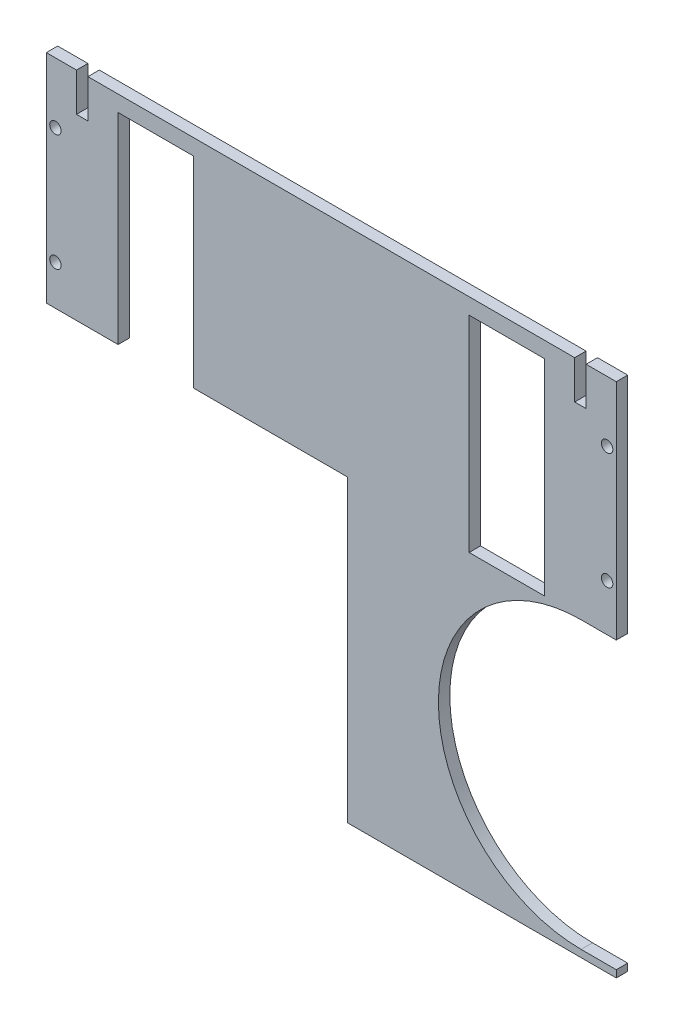
ISO-10303-21;
HEADER;
FILE_DESCRIPTION(('STEP AP214'),'2;1');
FILE_NAME('part.step','',(''),(''),'','','');
FILE_SCHEMA(('AUTOMOTIVE_DESIGN { 1 0 10303 214 1 1 1 1 }'));
ENDSEC;
DATA;
#1=APPLICATION_CONTEXT('core data for automotive mechanical design processes');
#2=APPLICATION_PROTOCOL_DEFINITION('international standard','automotive_design',2000,#1);
#3=PRODUCT_CONTEXT('',#1,'mechanical');
#4=PRODUCT('Part','Part','',(#3));
#5=PRODUCT_RELATED_PRODUCT_CATEGORY('part','',(#4));
#6=PRODUCT_DEFINITION_FORMATION('','',#4);
#7=PRODUCT_DEFINITION_CONTEXT('part definition',#1,'design');
#8=PRODUCT_DEFINITION('design','',#6,#7);
#9=PRODUCT_DEFINITION_SHAPE('','',#8);
#10=(LENGTH_UNIT() NAMED_UNIT(*) SI_UNIT(.MILLI.,.METRE.));
#11=(NAMED_UNIT(*) PLANE_ANGLE_UNIT() SI_UNIT($,.RADIAN.));
#12=(NAMED_UNIT(*) SI_UNIT($,.STERADIAN.) SOLID_ANGLE_UNIT());
#13=UNCERTAINTY_MEASURE_WITH_UNIT(LENGTH_MEASURE(1.E-05),#10,'distance_accuracy_value','');
#14=(GEOMETRIC_REPRESENTATION_CONTEXT(3) GLOBAL_UNCERTAINTY_ASSIGNED_CONTEXT((#13)) GLOBAL_UNIT_ASSIGNED_CONTEXT((#10,
#11,#12)) REPRESENTATION_CONTEXT('',''));
#15=CARTESIAN_POINT('',(0.,0.,0.));
#16=DIRECTION('',(0.,0.,1.));
#17=DIRECTION('',(1.,0.,0.));
#18=AXIS2_PLACEMENT_3D('',#15,#16,#17);
#19=CARTESIAN_POINT('',(8.39606162372775E-13,-69.0000000000026,5.));
#20=DIRECTION('',(0.,-1.,0.));
#21=DIRECTION('',(1.,0.,0.));
#22=AXIS2_PLACEMENT_3D('',#19,#20,#21);
#23=PLANE('',#22);
#24=DIRECTION('',(-1.,0.,0.));
#25=VECTOR('',#24,1.);
#26=CARTESIAN_POINT('',(8.39606162372775E-13,-69.0000000000026,5.));
#27=LINE('',#26,#25);
#28=CARTESIAN_POINT('',(13.22,-69.0000000000026,5.));
#29=VERTEX_POINT('',#28);
#30=CARTESIAN_POINT('',(8.39606162372775E-13,-69.0000000000026,5.));
#31=VERTEX_POINT('',#30);
#32=EDGE_CURVE('E400',#29,#31,#27,.T.);
#33=ORIENTED_EDGE('',*,*,#32,.F.);
#34=DIRECTION('',(0.,0.,-1.));
#35=VECTOR('',#34,1.);
#36=CARTESIAN_POINT('',(13.22,-69.0000000000026,5.));
#37=LINE('',#36,#35);
#38=CARTESIAN_POINT('',(13.22,-69.0000000000026,0.));
#39=VERTEX_POINT('',#38);
#40=EDGE_CURVE('E11',#29,#39,#37,.T.);
#41=ORIENTED_EDGE('',*,*,#40,.T.);
#42=DIRECTION('',(-1.,0.,0.));
#43=VECTOR('',#42,1.);
#44=CARTESIAN_POINT('',(8.39606162372775E-13,-69.0000000000026,0.));
#45=LINE('',#44,#43);
#46=CARTESIAN_POINT('',(8.39606162372775E-13,-69.0000000000026,0.));
#47=VERTEX_POINT('',#46);
#48=EDGE_CURVE('E408',#39,#47,#45,.T.);
#49=ORIENTED_EDGE('',*,*,#48,.T.);
#50=DIRECTION('',(0.,0.,-1.));
#51=VECTOR('',#50,1.);
#52=CARTESIAN_POINT('',(8.39606162372775E-13,-69.0000000000026,5.));
#53=LINE('',#52,#51);
#54=EDGE_CURVE('E398',#31,#47,#53,.T.);
#55=ORIENTED_EDGE('',*,*,#54,.F.);
#56=EDGE_LOOP('',(#33,#41,#49,#55));
#57=FACE_BOUND('',#56,.T.);
#58=ADVANCED_FACE('F33',(#57),#23,.F.);
#59=CARTESIAN_POINT('',(231.38,-69.0000000000026,0.));
#60=VERTEX_POINT('',#59);
#61=CARTESIAN_POINT('',(18.22,-69.0000000000026,0.));
#62=VERTEX_POINT('',#61);
#63=EDGE_CURVE('E232',#60,#62,#45,.T.);
#64=ORIENTED_EDGE('',*,*,#63,.T.);
#65=DIRECTION('',(0.,0.,1.));
#66=VECTOR('',#65,1.);
#67=CARTESIAN_POINT('',(18.22,-69.0000000000026,5.));
#68=LINE('',#67,#66);
#69=CARTESIAN_POINT('',(18.22,-69.0000000000026,5.));
#70=VERTEX_POINT('',#69);
#71=EDGE_CURVE('E41',#62,#70,#68,.T.);
#72=ORIENTED_EDGE('',*,*,#71,.T.);
#73=CARTESIAN_POINT('',(231.38,-69.0000000000026,5.));
#74=VERTEX_POINT('',#73);
#75=EDGE_CURVE('E399',#74,#70,#27,.T.);
#76=ORIENTED_EDGE('',*,*,#75,.F.);
#77=DIRECTION('',(0.,0.,-1.));
#78=VECTOR('',#77,1.);
#79=CARTESIAN_POINT('',(231.38,-69.0000000000026,5.));
#80=LINE('',#79,#78);
#81=EDGE_CURVE('E424',#74,#60,#80,.T.);
#82=ORIENTED_EDGE('',*,*,#81,.T.);
#83=EDGE_LOOP('',(#64,#72,#76,#82));
#84=FACE_BOUND('',#83,.T.);
#85=ADVANCED_FACE('F428',(#84),#23,.F.);
#86=CARTESIAN_POINT('',(249.600000000001,-69.0000000000026,5.));
#87=DIRECTION('',(-1.,0.,0.));
#88=DIRECTION('',(0.,-1.,0.));
#89=AXIS2_PLACEMENT_3D('',#86,#87,#88);
#90=PLANE('',#89);
#91=DIRECTION('',(0.,1.,0.));
#92=VECTOR('',#91,1.);
#93=CARTESIAN_POINT('',(249.600000000001,-69.0000000000026,5.));
#94=LINE('',#93,#92);
#95=CARTESIAN_POINT('',(249.600000000001,-167.000000000003,5.));
#96=VERTEX_POINT('',#95);
#97=CARTESIAN_POINT('',(249.600000000001,-69.0000000000026,5.));
#98=VERTEX_POINT('',#97);
#99=EDGE_CURVE('E391',#96,#98,#94,.T.);
#100=ORIENTED_EDGE('',*,*,#99,.F.);
#101=DIRECTION('',(0.,0.,-1.));
#102=VECTOR('',#101,1.);
#103=CARTESIAN_POINT('',(249.600000000001,-167.000000000003,5.));
#104=LINE('',#103,#102);
#105=CARTESIAN_POINT('',(249.600000000001,-167.000000000003,0.));
#106=VERTEX_POINT('',#105);
#107=EDGE_CURVE('E419',#96,#106,#104,.T.);
#108=ORIENTED_EDGE('',*,*,#107,.T.);
#109=DIRECTION('',(0.,1.,0.));
#110=VECTOR('',#109,1.);
#111=CARTESIAN_POINT('',(249.600000000001,-69.0000000000026,0.));
#112=LINE('',#111,#110);
#113=CARTESIAN_POINT('',(249.600000000001,-69.0000000000026,0.));
#114=VERTEX_POINT('',#113);
#115=EDGE_CURVE('E403',#106,#114,#112,.T.);
#116=ORIENTED_EDGE('',*,*,#115,.T.);
#117=DIRECTION('',(0.,0.,-1.));
#118=VECTOR('',#117,1.);
#119=CARTESIAN_POINT('',(249.600000000001,-69.0000000000026,5.));
#120=LINE('',#119,#118);
#121=EDGE_CURVE('E411',#98,#114,#120,.T.);
#122=ORIENTED_EDGE('',*,*,#121,.F.);
#123=EDGE_LOOP('',(#100,#108,#116,#122));
#124=FACE_BOUND('',#123,.T.);
#125=ADVANCED_FACE('F460',(#124),#90,.F.);
#126=CARTESIAN_POINT('',(0.,0.,5.));
#127=DIRECTION('',(0.,0.,1.));
#128=DIRECTION('',(1.,0.,0.));
#129=AXIS2_PLACEMENT_3D('',#126,#127,#128);
#130=PLANE('',#129);
#131=DIRECTION('',(0.,-1.,0.));
#132=VECTOR('',#131,1.);
#133=CARTESIAN_POINT('',(13.22,-60.8123202998395,5.));
#134=LINE('',#133,#132);
#135=CARTESIAN_POINT('',(13.22,-85.8123202998395,5.));
#136=VERTEX_POINT('',#135);
#137=EDGE_CURVE('E252',#29,#136,#134,.T.);
#138=ORIENTED_EDGE('',*,*,#137,.F.);
#139=ORIENTED_EDGE('',*,*,#32,.T.);
#140=DIRECTION('',(0.,-1.,0.));
#141=VECTOR('',#140,1.);
#142=CARTESIAN_POINT('',(8.39606162372775E-13,-69.0000000000026,5.));
#143=LINE('',#142,#141);
#144=CARTESIAN_POINT('',(8.32667268468867E-13,-164.000000000003,5.));
#145=VERTEX_POINT('',#144);
#146=EDGE_CURVE('E388',#31,#145,#143,.T.);
#147=ORIENTED_EDGE('',*,*,#146,.T.);
#148=DIRECTION('',(-1.,0.,0.));
#149=VECTOR('',#148,1.);
#150=CARTESIAN_POINT('',(8.32667268468867E-13,-164.000000000003,5.));
#151=LINE('',#150,#149);
#152=CARTESIAN_POINT('',(31.4400000000009,-164.000000000003,5.));
#153=VERTEX_POINT('',#152);
#154=EDGE_CURVE('E296',#153,#145,#151,.T.);
#155=ORIENTED_EDGE('',*,*,#154,.F.);
#156=DIRECTION('',(0.,-1.,0.));
#157=VECTOR('',#156,1.);
#158=CARTESIAN_POINT('',(31.4400000000009,-76.0000000000026,5.));
#159=LINE('',#158,#157);
#160=CARTESIAN_POINT('',(31.4400000000009,-76.0000000000026,5.));
#161=VERTEX_POINT('',#160);
#162=EDGE_CURVE('E314',#161,#153,#159,.T.);
#163=ORIENTED_EDGE('',*,*,#162,.F.);
#164=DIRECTION('',(-1.,0.,0.));
#165=VECTOR('',#164,1.);
#166=CARTESIAN_POINT('',(64.4400000000009,-76.0000000000026,5.));
#167=LINE('',#166,#165);
#168=CARTESIAN_POINT('',(64.4400000000009,-76.0000000000026,5.));
#169=VERTEX_POINT('',#168);
#170=EDGE_CURVE('E312',#169,#161,#167,.T.);
#171=ORIENTED_EDGE('',*,*,#170,.F.);
#172=DIRECTION('',(0.,1.,0.));
#173=VECTOR('',#172,1.);
#174=CARTESIAN_POINT('',(64.4400000000009,-76.0000000000026,5.));
#175=LINE('',#174,#173);
#176=CARTESIAN_POINT('',(64.4400000000009,-164.000000000003,5.));
#177=VERTEX_POINT('',#176);
#178=EDGE_CURVE('E318',#177,#169,#175,.T.);
#179=ORIENTED_EDGE('',*,*,#178,.F.);
#180=CARTESIAN_POINT('',(132.000000000001,-164.000000000003,5.));
#181=VERTEX_POINT('',#180);
#182=EDGE_CURVE('E297',#181,#177,#151,.T.);
#183=ORIENTED_EDGE('',*,*,#182,.F.);
#184=DIRECTION('',(0.,1.,0.));
#185=VECTOR('',#184,1.);
#186=CARTESIAN_POINT('',(132.000000000001,-295.148008476666,5.));
#187=LINE('',#186,#185);
#188=CARTESIAN_POINT('',(132.000000000001,-295.148008476666,5.));
#189=VERTEX_POINT('',#188);
#190=EDGE_CURVE('E280',#189,#181,#187,.T.);
#191=ORIENTED_EDGE('',*,*,#190,.F.);
#192=DIRECTION('',(-1.,0.,0.));
#193=VECTOR('',#192,1.);
#194=CARTESIAN_POINT('',(132.000000000001,-295.148008476666,5.));
#195=LINE('',#194,#193);
#196=CARTESIAN_POINT('',(249.600000000001,-295.148008476666,5.));
#197=VERTEX_POINT('',#196);
#198=EDGE_CURVE('E286',#197,#189,#195,.T.);
#199=ORIENTED_EDGE('',*,*,#198,.F.);
#200=CARTESIAN_POINT('',(249.600000000001,-292.000000000003,5.));
#201=VERTEX_POINT('',#200);
#202=EDGE_CURVE('E394',#197,#201,#94,.T.);
#203=ORIENTED_EDGE('',*,*,#202,.T.);
#204=DIRECTION('',(1.,0.,0.));
#205=VECTOR('',#204,1.);
#206=CARTESIAN_POINT('',(234.205987927565,-292.000000000003,5.));
#207=LINE('',#206,#205);
#208=CARTESIAN_POINT('',(234.205987927565,-292.000000000003,5.));
#209=VERTEX_POINT('',#208);
#210=EDGE_CURVE('E274',#209,#201,#207,.T.);
#211=ORIENTED_EDGE('',*,*,#210,.F.);
#212=CARTESIAN_POINT('',(234.205987927565,-229.500000000003,5.));
#213=DIRECTION('',(0.,0.,1.));
#214=DIRECTION('',(1.,0.,0.));
#215=AXIS2_PLACEMENT_3D('',#212,#213,#214);
#216=CIRCLE('',#215,62.5);
#217=CARTESIAN_POINT('',(234.205987927565,-167.000000000003,5.));
#218=VERTEX_POINT('',#217);
#219=EDGE_CURVE('E241',#218,#209,#216,.T.);
#220=ORIENTED_EDGE('',*,*,#219,.F.);
#221=DIRECTION('',(-1.,0.,0.));
#222=VECTOR('',#221,1.);
#223=CARTESIAN_POINT('',(296.705987927565,-167.000000000003,5.));
#224=LINE('',#223,#222);
#225=EDGE_CURVE('E265',#96,#218,#224,.T.);
#226=ORIENTED_EDGE('',*,*,#225,.F.);
#227=ORIENTED_EDGE('',*,*,#99,.T.);
#228=CARTESIAN_POINT('',(236.38,-69.0000000000026,5.));
#229=VERTEX_POINT('',#228);
#230=EDGE_CURVE('E395',#98,#229,#27,.T.);
#231=ORIENTED_EDGE('',*,*,#230,.T.);
#232=DIRECTION('',(0.,1.,0.));
#233=VECTOR('',#232,1.);
#234=CARTESIAN_POINT('',(236.38,-60.8123202998395,5.));
#235=LINE('',#234,#233);
#236=CARTESIAN_POINT('',(236.38,-85.8123202998395,5.));
#237=VERTEX_POINT('',#236);
#238=EDGE_CURVE('E56',#237,#229,#235,.T.);
#239=ORIENTED_EDGE('',*,*,#238,.F.);
#240=DIRECTION('',(1.,0.,0.));
#241=VECTOR('',#240,1.);
#242=CARTESIAN_POINT('',(231.38,-85.8123202998395,5.));
#243=LINE('',#242,#241);
#244=CARTESIAN_POINT('',(231.38,-85.8123202998395,5.));
#245=VERTEX_POINT('',#244);
#246=EDGE_CURVE('E234',#245,#237,#243,.T.);
#247=ORIENTED_EDGE('',*,*,#246,.F.);
#248=DIRECTION('',(0.,-1.,0.));
#249=VECTOR('',#248,1.);
#250=CARTESIAN_POINT('',(231.38,-60.8123202998395,5.));
#251=LINE('',#250,#249);
#252=EDGE_CURVE('E212',#74,#245,#251,.T.);
#253=ORIENTED_EDGE('',*,*,#252,.F.);
#254=ORIENTED_EDGE('',*,*,#75,.T.);
#255=DIRECTION('',(0.,1.,0.));
#256=VECTOR('',#255,1.);
#257=CARTESIAN_POINT('',(18.22,-60.8123202998395,5.));
#258=LINE('',#257,#256);
#259=CARTESIAN_POINT('',(18.22,-85.8123202998395,5.));
#260=VERTEX_POINT('',#259);
#261=EDGE_CURVE('E48',#260,#70,#258,.T.);
#262=ORIENTED_EDGE('',*,*,#261,.F.);
#263=DIRECTION('',(1.,0.,0.));
#264=VECTOR('',#263,1.);
#265=CARTESIAN_POINT('',(13.22,-85.8123202998395,5.));
#266=LINE('',#265,#264);
#267=EDGE_CURVE('E254',#136,#260,#266,.T.);
#268=ORIENTED_EDGE('',*,*,#267,.F.);
#269=EDGE_LOOP('',(#138,#139,#147,#155,#163,#171,#179,#183,#191,#199,#203,#211,#220,#226,#227,
#231,#239,#247,#253,#254,#262,#268));
#270=FACE_BOUND('',#269,.T.);
#271=CARTESIAN_POINT('',(4.00000000000086,-146.500000000003,5.));
#272=DIRECTION('',(0.,0.,1.));
#273=DIRECTION('',(-1.,0.,0.));
#274=AXIS2_PLACEMENT_3D('',#271,#272,#273);
#275=CIRCLE('',#274,2.50000000000002);
#276=CARTESIAN_POINT('',(1.50000000000084,-146.500000000003,5.));
#277=VERTEX_POINT('',#276);
#278=EDGE_CURVE('E339',#277,#277,#275,.T.);
#279=ORIENTED_EDGE('',*,*,#278,.F.);
#280=EDGE_LOOP('',(#279));
#281=FACE_BOUND('',#280,.T.);
#282=CARTESIAN_POINT('',(245.600000000001,-95.5000000000026,5.));
#283=DIRECTION('',(0.,0.,1.));
#284=DIRECTION('',(1.,0.,0.));
#285=AXIS2_PLACEMENT_3D('',#282,#283,#284);
#286=CIRCLE('',#285,2.50000000000002);
#287=CARTESIAN_POINT('',(248.100000000001,-95.5000000000026,5.));
#288=VERTEX_POINT('',#287);
#289=EDGE_CURVE('E351',#288,#288,#286,.T.);
#290=ORIENTED_EDGE('',*,*,#289,.F.);
#291=EDGE_LOOP('',(#290));
#292=FACE_BOUND('',#291,.T.);
#293=DIRECTION('',(1.,0.,0.));
#294=VECTOR('',#293,1.);
#295=CARTESIAN_POINT('',(185.160000000001,-166.000000000003,5.));
#296=LINE('',#295,#294);
#297=CARTESIAN_POINT('',(185.160000000001,-166.000000000003,5.));
#298=VERTEX_POINT('',#297);
#299=CARTESIAN_POINT('',(218.160000000001,-166.000000000003,5.));
#300=VERTEX_POINT('',#299);
#301=EDGE_CURVE('E359',#298,#300,#296,.T.);
#302=ORIENTED_EDGE('',*,*,#301,.F.);
#303=DIRECTION('',(0.,-1.,0.));
#304=VECTOR('',#303,1.);
#305=CARTESIAN_POINT('',(185.160000000001,-76.0000000000026,5.));
#306=LINE('',#305,#304);
#307=CARTESIAN_POINT('',(185.160000000001,-76.0000000000026,5.));
#308=VERTEX_POINT('',#307);
#309=EDGE_CURVE('E357',#308,#298,#306,.T.);
#310=ORIENTED_EDGE('',*,*,#309,.F.);
#311=DIRECTION('',(-1.,0.,0.));
#312=VECTOR('',#311,1.);
#313=CARTESIAN_POINT('',(185.160000000001,-76.0000000000026,5.));
#314=LINE('',#313,#312);
#315=CARTESIAN_POINT('',(218.160000000001,-76.0000000000026,5.));
#316=VERTEX_POINT('',#315);
#317=EDGE_CURVE('E365',#316,#308,#314,.T.);
#318=ORIENTED_EDGE('',*,*,#317,.F.);
#319=DIRECTION('',(0.,1.,0.));
#320=VECTOR('',#319,1.);
#321=CARTESIAN_POINT('',(218.160000000001,-76.0000000000026,5.));
#322=LINE('',#321,#320);
#323=EDGE_CURVE('E362',#300,#316,#322,.T.);
#324=ORIENTED_EDGE('',*,*,#323,.F.);
#325=EDGE_LOOP('',(#302,#310,#318,#324));
#326=FACE_BOUND('',#325,.T.);
#327=CARTESIAN_POINT('',(245.600000000001,-146.500000000003,5.));
#328=DIRECTION('',(0.,0.,1.));
#329=DIRECTION('',(1.,0.,0.));
#330=AXIS2_PLACEMENT_3D('',#327,#328,#329);
#331=CIRCLE('',#330,2.50000000000002);
#332=CARTESIAN_POINT('',(248.100000000001,-146.500000000003,5.));
#333=VERTEX_POINT('',#332);
#334=EDGE_CURVE('E345',#333,#333,#331,.T.);
#335=ORIENTED_EDGE('',*,*,#334,.F.);
#336=EDGE_LOOP('',(#335));
#337=FACE_BOUND('',#336,.T.);
#338=CARTESIAN_POINT('',(4.00000000000086,-95.5000000000026,5.));
#339=DIRECTION('',(0.,0.,1.));
#340=DIRECTION('',(-1.,0.,0.));
#341=AXIS2_PLACEMENT_3D('',#338,#339,#340);
#342=CIRCLE('',#341,2.50000000000002);
#343=CARTESIAN_POINT('',(1.50000000000084,-95.5000000000026,5.));
#344=VERTEX_POINT('',#343);
#345=EDGE_CURVE('E333',#344,#344,#342,.T.);
#346=ORIENTED_EDGE('',*,*,#345,.F.);
#347=EDGE_LOOP('',(#346));
#348=FACE_BOUND('',#347,.T.);
#349=ADVANCED_FACE('F432',(#270,#281,#292,#326,#337,#348),#130,.T.);
#350=CARTESIAN_POINT('',(0.,0.,0.));
#351=DIRECTION('',(0.,0.,1.));
#352=DIRECTION('',(1.,0.,0.));
#353=AXIS2_PLACEMENT_3D('',#350,#351,#352);
#354=PLANE('',#353);
#355=ORIENTED_EDGE('',*,*,#48,.F.);
#356=DIRECTION('',(0.,-1.,0.));
#357=VECTOR('',#356,1.);
#358=CARTESIAN_POINT('',(13.22,-60.8123202998395,0.));
#359=LINE('',#358,#357);
#360=CARTESIAN_POINT('',(13.22,-85.8123202998395,0.));
#361=VERTEX_POINT('',#360);
#362=EDGE_CURVE('E243',#39,#361,#359,.T.);
#363=ORIENTED_EDGE('',*,*,#362,.T.);
#364=DIRECTION('',(1.,0.,0.));
#365=VECTOR('',#364,1.);
#366=CARTESIAN_POINT('',(13.22,-85.8123202998395,0.));
#367=LINE('',#366,#365);
#368=CARTESIAN_POINT('',(18.22,-85.8123202998395,0.));
#369=VERTEX_POINT('',#368);
#370=EDGE_CURVE('E246',#361,#369,#367,.T.);
#371=ORIENTED_EDGE('',*,*,#370,.T.);
#372=DIRECTION('',(0.,1.,0.));
#373=VECTOR('',#372,1.);
#374=CARTESIAN_POINT('',(18.22,-60.8123202998395,0.));
#375=LINE('',#374,#373);
#376=EDGE_CURVE('E249',#369,#62,#375,.T.);
#377=ORIENTED_EDGE('',*,*,#376,.T.);
#378=ORIENTED_EDGE('',*,*,#63,.F.);
#379=DIRECTION('',(0.,-1.,0.));
#380=VECTOR('',#379,1.);
#381=CARTESIAN_POINT('',(231.38,-60.8123202998395,0.));
#382=LINE('',#381,#380);
#383=CARTESIAN_POINT('',(231.38,-85.8123202998395,0.));
#384=VERTEX_POINT('',#383);
#385=EDGE_CURVE('E209',#60,#384,#382,.T.);
#386=ORIENTED_EDGE('',*,*,#385,.T.);
#387=DIRECTION('',(1.,0.,0.));
#388=VECTOR('',#387,1.);
#389=CARTESIAN_POINT('',(231.38,-85.8123202998395,0.));
#390=LINE('',#389,#388);
#391=CARTESIAN_POINT('',(236.38,-85.8123202998395,0.));
#392=VERTEX_POINT('',#391);
#393=EDGE_CURVE('E220',#384,#392,#390,.T.);
#394=ORIENTED_EDGE('',*,*,#393,.T.);
#395=DIRECTION('',(0.,1.,0.));
#396=VECTOR('',#395,1.);
#397=CARTESIAN_POINT('',(236.38,-60.8123202998395,0.));
#398=LINE('',#397,#396);
#399=CARTESIAN_POINT('',(236.38,-69.0000000000026,0.));
#400=VERTEX_POINT('',#399);
#401=EDGE_CURVE('E217',#392,#400,#398,.T.);
#402=ORIENTED_EDGE('',*,*,#401,.T.);
#403=EDGE_CURVE('E392',#114,#400,#45,.T.);
#404=ORIENTED_EDGE('',*,*,#403,.F.);
#405=ORIENTED_EDGE('',*,*,#115,.F.);
#406=DIRECTION('',(-1.,0.,0.));
#407=VECTOR('',#406,1.);
#408=CARTESIAN_POINT('',(296.705987927565,-167.000000000003,0.));
#409=LINE('',#408,#407);
#410=CARTESIAN_POINT('',(234.205987927565,-167.000000000003,0.));
#411=VERTEX_POINT('',#410);
#412=EDGE_CURVE('E268',#106,#411,#409,.T.);
#413=ORIENTED_EDGE('',*,*,#412,.T.);
#414=CARTESIAN_POINT('',(234.205987927565,-229.500000000003,0.));
#415=DIRECTION('',(0.,0.,1.));
#416=DIRECTION('',(1.,0.,0.));
#417=AXIS2_PLACEMENT_3D('',#414,#415,#416);
#418=CIRCLE('',#417,62.5);
#419=CARTESIAN_POINT('',(234.205987927565,-292.000000000003,0.));
#420=VERTEX_POINT('',#419);
#421=EDGE_CURVE('E261',#411,#420,#418,.T.);
#422=ORIENTED_EDGE('',*,*,#421,.T.);
#423=DIRECTION('',(1.,0.,0.));
#424=VECTOR('',#423,1.);
#425=CARTESIAN_POINT('',(234.205987927565,-292.000000000003,0.));
#426=LINE('',#425,#424);
#427=CARTESIAN_POINT('',(249.600000000001,-292.000000000003,0.));
#428=VERTEX_POINT('',#427);
#429=EDGE_CURVE('E264',#420,#428,#426,.T.);
#430=ORIENTED_EDGE('',*,*,#429,.T.);
#431=CARTESIAN_POINT('',(249.600000000001,-295.148008476666,0.));
#432=VERTEX_POINT('',#431);
#433=EDGE_CURVE('E405',#432,#428,#112,.T.);
#434=ORIENTED_EDGE('',*,*,#433,.F.);
#435=DIRECTION('',(-1.,0.,0.));
#436=VECTOR('',#435,1.);
#437=CARTESIAN_POINT('',(132.000000000001,-295.148008476666,0.));
#438=LINE('',#437,#436);
#439=CARTESIAN_POINT('',(132.000000000001,-295.148008476666,0.));
#440=VERTEX_POINT('',#439);
#441=EDGE_CURVE('E290',#432,#440,#438,.T.);
#442=ORIENTED_EDGE('',*,*,#441,.T.);
#443=DIRECTION('',(0.,1.,0.));
#444=VECTOR('',#443,1.);
#445=CARTESIAN_POINT('',(132.000000000001,-295.148008476666,0.));
#446=LINE('',#445,#444);
#447=CARTESIAN_POINT('',(132.000000000001,-164.000000000003,0.));
#448=VERTEX_POINT('',#447);
#449=EDGE_CURVE('E282',#440,#448,#446,.T.);
#450=ORIENTED_EDGE('',*,*,#449,.T.);
#451=DIRECTION('',(-1.,0.,0.));
#452=VECTOR('',#451,1.);
#453=CARTESIAN_POINT('',(8.32667268468867E-13,-164.000000000003,0.));
#454=LINE('',#453,#452);
#455=CARTESIAN_POINT('',(64.4400000000009,-164.000000000003,0.));
#456=VERTEX_POINT('',#455);
#457=EDGE_CURVE('E287',#448,#456,#454,.T.);
#458=ORIENTED_EDGE('',*,*,#457,.T.);
#459=DIRECTION('',(0.,1.,0.));
#460=VECTOR('',#459,1.);
#461=CARTESIAN_POINT('',(64.4400000000009,-76.0000000000026,0.));
#462=LINE('',#461,#460);
#463=CARTESIAN_POINT('',(64.4400000000009,-76.0000000000026,0.));
#464=VERTEX_POINT('',#463);
#465=EDGE_CURVE('E315',#456,#464,#462,.T.);
#466=ORIENTED_EDGE('',*,*,#465,.T.);
#467=DIRECTION('',(-1.,0.,0.));
#468=VECTOR('',#467,1.);
#469=CARTESIAN_POINT('',(64.4400000000009,-76.0000000000026,0.));
#470=LINE('',#469,#468);
#471=CARTESIAN_POINT('',(31.4400000000009,-76.0000000000026,0.));
#472=VERTEX_POINT('',#471);
#473=EDGE_CURVE('E311',#464,#472,#470,.T.);
#474=ORIENTED_EDGE('',*,*,#473,.T.);
#475=DIRECTION('',(0.,-1.,0.));
#476=VECTOR('',#475,1.);
#477=CARTESIAN_POINT('',(31.4400000000009,-76.0000000000026,0.));
#478=LINE('',#477,#476);
#479=CARTESIAN_POINT('',(31.4400000000009,-164.000000000003,0.));
#480=VERTEX_POINT('',#479);
#481=EDGE_CURVE('E323',#472,#480,#478,.T.);
#482=ORIENTED_EDGE('',*,*,#481,.T.);
#483=CARTESIAN_POINT('',(8.32667268468867E-13,-164.000000000003,0.));
#484=VERTEX_POINT('',#483);
#485=EDGE_CURVE('E285',#480,#484,#454,.T.);
#486=ORIENTED_EDGE('',*,*,#485,.T.);
#487=DIRECTION('',(0.,-1.,0.));
#488=VECTOR('',#487,1.);
#489=CARTESIAN_POINT('',(8.39606162372775E-13,-69.0000000000026,0.));
#490=LINE('',#489,#488);
#491=EDGE_CURVE('E387',#47,#484,#490,.T.);
#492=ORIENTED_EDGE('',*,*,#491,.F.);
#493=EDGE_LOOP('',(#355,#363,#371,#377,#378,#386,#394,#402,#404,#405,#413,#422,#430,#434,#442,
#450,#458,#466,#474,#482,#486,#492));
#494=FACE_BOUND('',#493,.T.);
#495=CARTESIAN_POINT('',(4.00000000000086,-95.5000000000026,0.));
#496=DIRECTION('',(0.,0.,1.));
#497=DIRECTION('',(-1.,0.,0.));
#498=AXIS2_PLACEMENT_3D('',#495,#496,#497);
#499=CIRCLE('',#498,2.50000000000002);
#500=CARTESIAN_POINT('',(1.50000000000084,-95.5000000000026,0.));
#501=VERTEX_POINT('',#500);
#502=EDGE_CURVE('E332',#501,#501,#499,.T.);
#503=ORIENTED_EDGE('',*,*,#502,.T.);
#504=EDGE_LOOP('',(#503));
#505=FACE_BOUND('',#504,.T.);
#506=CARTESIAN_POINT('',(4.00000000000086,-146.500000000003,0.));
#507=DIRECTION('',(0.,0.,1.));
#508=DIRECTION('',(-1.,0.,0.));
#509=AXIS2_PLACEMENT_3D('',#506,#507,#508);
#510=CIRCLE('',#509,2.50000000000002);
#511=CARTESIAN_POINT('',(1.50000000000084,-146.500000000003,0.));
#512=VERTEX_POINT('',#511);
#513=EDGE_CURVE('E336',#512,#512,#510,.T.);
#514=ORIENTED_EDGE('',*,*,#513,.T.);
#515=EDGE_LOOP('',(#514));
#516=FACE_BOUND('',#515,.T.);
#517=CARTESIAN_POINT('',(245.600000000001,-146.500000000003,0.));
#518=DIRECTION('',(0.,0.,1.));
#519=DIRECTION('',(1.,0.,0.));
#520=AXIS2_PLACEMENT_3D('',#517,#518,#519);
#521=CIRCLE('',#520,2.50000000000002);
#522=CARTESIAN_POINT('',(248.100000000001,-146.500000000003,0.));
#523=VERTEX_POINT('',#522);
#524=EDGE_CURVE('E342',#523,#523,#521,.T.);
#525=ORIENTED_EDGE('',*,*,#524,.T.);
#526=EDGE_LOOP('',(#525));
#527=FACE_BOUND('',#526,.T.);
#528=CARTESIAN_POINT('',(245.600000000001,-95.5000000000026,0.));
#529=DIRECTION('',(0.,0.,1.));
#530=DIRECTION('',(1.,0.,0.));
#531=AXIS2_PLACEMENT_3D('',#528,#529,#530);
#532=CIRCLE('',#531,2.50000000000002);
#533=CARTESIAN_POINT('',(248.100000000001,-95.5000000000026,0.));
#534=VERTEX_POINT('',#533);
#535=EDGE_CURVE('E348',#534,#534,#532,.T.);
#536=ORIENTED_EDGE('',*,*,#535,.T.);
#537=EDGE_LOOP('',(#536));
#538=FACE_BOUND('',#537,.T.);
#539=DIRECTION('',(0.,-1.,0.));
#540=VECTOR('',#539,1.);
#541=CARTESIAN_POINT('',(185.160000000001,-76.0000000000026,0.));
#542=LINE('',#541,#540);
#543=CARTESIAN_POINT('',(185.160000000001,-76.0000000000026,0.));
#544=VERTEX_POINT('',#543);
#545=CARTESIAN_POINT('',(185.160000000001,-166.000000000003,0.));
#546=VERTEX_POINT('',#545);
#547=EDGE_CURVE('E354',#544,#546,#542,.T.);
#548=ORIENTED_EDGE('',*,*,#547,.T.);
#549=DIRECTION('',(1.,0.,0.));
#550=VECTOR('',#549,1.);
#551=CARTESIAN_POINT('',(185.160000000001,-166.000000000003,0.));
#552=LINE('',#551,#550);
#553=CARTESIAN_POINT('',(218.160000000001,-166.000000000003,0.));
#554=VERTEX_POINT('',#553);
#555=EDGE_CURVE('E370',#546,#554,#552,.T.);
#556=ORIENTED_EDGE('',*,*,#555,.T.);
#557=DIRECTION('',(0.,1.,0.));
#558=VECTOR('',#557,1.);
#559=CARTESIAN_POINT('',(218.160000000001,-76.0000000000026,0.));
#560=LINE('',#559,#558);
#561=CARTESIAN_POINT('',(218.160000000001,-76.0000000000026,0.));
#562=VERTEX_POINT('',#561);
#563=EDGE_CURVE('E373',#554,#562,#560,.T.);
#564=ORIENTED_EDGE('',*,*,#563,.T.);
#565=DIRECTION('',(-1.,0.,0.));
#566=VECTOR('',#565,1.);
#567=CARTESIAN_POINT('',(185.160000000001,-76.0000000000026,0.));
#568=LINE('',#567,#566);
#569=EDGE_CURVE('E360',#562,#544,#568,.T.);
#570=ORIENTED_EDGE('',*,*,#569,.T.);
#571=EDGE_LOOP('',(#548,#556,#564,#570));
#572=FACE_BOUND('',#571,.T.);
#573=ADVANCED_FACE('F228',(#494,#505,#516,#527,#538,#572),#354,.F.);
#574=CARTESIAN_POINT('',(8.39606162372775E-13,-69.0000000000026,5.));
#575=DIRECTION('',(1.,0.,0.));
#576=DIRECTION('',(0.,1.,0.));
#577=AXIS2_PLACEMENT_3D('',#574,#575,#576);
#578=PLANE('',#577);
#579=ORIENTED_EDGE('',*,*,#491,.T.);
#580=DIRECTION('',(0.,0.,1.));
#581=VECTOR('',#580,1.);
#582=CARTESIAN_POINT('',(8.32667268468867E-13,-164.000000000003,0.));
#583=LINE('',#582,#581);
#584=EDGE_CURVE('E306',#484,#145,#583,.T.);
#585=ORIENTED_EDGE('',*,*,#584,.T.);
#586=ORIENTED_EDGE('',*,*,#146,.F.);
#587=ORIENTED_EDGE('',*,*,#54,.T.);
#588=EDGE_LOOP('',(#579,#585,#586,#587));
#589=FACE_BOUND('',#588,.T.);
#590=ADVANCED_FACE('F35',(#589),#578,.F.);
#591=ORIENTED_EDGE('',*,*,#433,.T.);
#592=DIRECTION('',(0.,0.,1.));
#593=VECTOR('',#592,1.);
#594=CARTESIAN_POINT('',(249.600000000001,-292.000000000003,5.));
#595=LINE('',#594,#593);
#596=EDGE_CURVE('E416',#428,#201,#595,.T.);
#597=ORIENTED_EDGE('',*,*,#596,.T.);
#598=ORIENTED_EDGE('',*,*,#202,.F.);
#599=DIRECTION('',(0.,0.,1.));
#600=VECTOR('',#599,1.);
#601=CARTESIAN_POINT('',(249.600000000001,-295.148008476666,0.));
#602=LINE('',#601,#600);
#603=EDGE_CURVE('E304',#432,#197,#602,.T.);
#604=ORIENTED_EDGE('',*,*,#603,.F.);
#605=EDGE_LOOP('',(#591,#597,#598,#604));
#606=FACE_BOUND('',#605,.T.);
#607=ADVANCED_FACE('F446',(#606),#90,.F.);
#608=ORIENTED_EDGE('',*,*,#403,.T.);
#609=DIRECTION('',(0.,0.,1.));
#610=VECTOR('',#609,1.);
#611=CARTESIAN_POINT('',(236.38,-69.0000000000026,5.));
#612=LINE('',#611,#610);
#613=EDGE_CURVE('E422',#400,#229,#612,.T.);
#614=ORIENTED_EDGE('',*,*,#613,.T.);
#615=ORIENTED_EDGE('',*,*,#230,.F.);
#616=ORIENTED_EDGE('',*,*,#121,.T.);
#617=EDGE_LOOP('',(#608,#614,#615,#616));
#618=FACE_BOUND('',#617,.T.);
#619=ADVANCED_FACE('F464',(#618),#23,.F.);
#620=CARTESIAN_POINT('',(185.160000000001,-76.0000000000026,5.));
#621=DIRECTION('',(1.,0.,0.));
#622=DIRECTION('',(0.,0.,-1.));
#623=AXIS2_PLACEMENT_3D('',#620,#621,#622);
#624=PLANE('',#623);
#625=ORIENTED_EDGE('',*,*,#547,.F.);
#626=DIRECTION('',(0.,0.,-1.));
#627=VECTOR('',#626,1.);
#628=CARTESIAN_POINT('',(185.160000000001,-76.0000000000026,5.));
#629=LINE('',#628,#627);
#630=EDGE_CURVE('E367',#308,#544,#629,.T.);
#631=ORIENTED_EDGE('',*,*,#630,.F.);
#632=ORIENTED_EDGE('',*,*,#309,.T.);
#633=DIRECTION('',(0.,0.,-1.));
#634=VECTOR('',#633,1.);
#635=CARTESIAN_POINT('',(185.160000000001,-166.000000000003,5.));
#636=LINE('',#635,#634);
#637=EDGE_CURVE('E384',#298,#546,#636,.T.);
#638=ORIENTED_EDGE('',*,*,#637,.T.);
#639=EDGE_LOOP('',(#625,#631,#632,#638));
#640=FACE_BOUND('',#639,.T.);
#641=ADVANCED_FACE('F483',(#640),#624,.T.);
#642=CARTESIAN_POINT('',(185.160000000001,-166.000000000003,5.));
#643=DIRECTION('',(0.,1.,0.));
#644=DIRECTION('',(0.,0.,1.));
#645=AXIS2_PLACEMENT_3D('',#642,#643,#644);
#646=PLANE('',#645);
#647=ORIENTED_EDGE('',*,*,#555,.F.);
#648=ORIENTED_EDGE('',*,*,#637,.F.);
#649=ORIENTED_EDGE('',*,*,#301,.T.);
#650=DIRECTION('',(0.,0.,-1.));
#651=VECTOR('',#650,1.);
#652=CARTESIAN_POINT('',(218.160000000001,-166.000000000003,5.));
#653=LINE('',#652,#651);
#654=EDGE_CURVE('E382',#300,#554,#653,.T.);
#655=ORIENTED_EDGE('',*,*,#654,.T.);
#656=EDGE_LOOP('',(#647,#648,#649,#655));
#657=FACE_BOUND('',#656,.T.);
#658=ADVANCED_FACE('F488',(#657),#646,.T.);
#659=CARTESIAN_POINT('',(218.160000000001,-76.0000000000026,5.));
#660=DIRECTION('',(-1.,0.,0.));
#661=DIRECTION('',(0.,0.,1.));
#662=AXIS2_PLACEMENT_3D('',#659,#660,#661);
#663=PLANE('',#662);
#664=ORIENTED_EDGE('',*,*,#563,.F.);
#665=ORIENTED_EDGE('',*,*,#654,.F.);
#666=ORIENTED_EDGE('',*,*,#323,.T.);
#667=DIRECTION('',(0.,0.,-1.));
#668=VECTOR('',#667,1.);
#669=CARTESIAN_POINT('',(218.160000000001,-76.0000000000026,5.));
#670=LINE('',#669,#668);
#671=EDGE_CURVE('E380',#316,#562,#670,.T.);
#672=ORIENTED_EDGE('',*,*,#671,.T.);
#673=EDGE_LOOP('',(#664,#665,#666,#672));
#674=FACE_BOUND('',#673,.T.);
#675=ADVANCED_FACE('F506',(#674),#663,.T.);
#676=CARTESIAN_POINT('',(185.160000000001,-76.0000000000026,5.));
#677=DIRECTION('',(0.,-1.,0.));
#678=DIRECTION('',(1.,0.,0.));
#679=AXIS2_PLACEMENT_3D('',#676,#677,#678);
#680=PLANE('',#679);
#681=ORIENTED_EDGE('',*,*,#569,.F.);
#682=ORIENTED_EDGE('',*,*,#671,.F.);
#683=ORIENTED_EDGE('',*,*,#317,.T.);
#684=ORIENTED_EDGE('',*,*,#630,.T.);
#685=EDGE_LOOP('',(#681,#682,#683,#684));
#686=FACE_BOUND('',#685,.T.);
#687=ADVANCED_FACE('F510',(#686),#680,.T.);
#688=CARTESIAN_POINT('',(245.600000000001,-95.5000000000026,5.));
#689=DIRECTION('',(0.,0.,-1.));
#690=DIRECTION('',(-1.,0.,0.));
#691=AXIS2_PLACEMENT_3D('',#688,#689,#690);
#692=CYLINDRICAL_SURFACE('',#691,2.50000000000002);
#693=ORIENTED_EDGE('',*,*,#289,.T.);
#694=EDGE_LOOP('',(#693));
#695=FACE_BOUND('',#694,.T.);
#696=ORIENTED_EDGE('',*,*,#535,.F.);
#697=EDGE_LOOP('',(#696));
#698=FACE_BOUND('',#697,.T.);
#699=ADVANCED_FACE('F514',(#695,#698),#692,.F.);
#700=CARTESIAN_POINT('',(245.600000000001,-146.500000000003,5.));
#701=DIRECTION('',(0.,0.,-1.));
#702=DIRECTION('',(-1.,0.,0.));
#703=AXIS2_PLACEMENT_3D('',#700,#701,#702);
#704=CYLINDRICAL_SURFACE('',#703,2.50000000000002);
#705=ORIENTED_EDGE('',*,*,#334,.T.);
#706=EDGE_LOOP('',(#705));
#707=FACE_BOUND('',#706,.T.);
#708=ORIENTED_EDGE('',*,*,#524,.F.);
#709=EDGE_LOOP('',(#708));
#710=FACE_BOUND('',#709,.T.);
#711=ADVANCED_FACE('F518',(#707,#710),#704,.F.);
#712=CARTESIAN_POINT('',(4.00000000000086,-146.500000000003,5.));
#713=DIRECTION('',(0.,0.,-1.));
#714=DIRECTION('',(-1.,0.,0.));
#715=AXIS2_PLACEMENT_3D('',#712,#713,#714);
#716=CYLINDRICAL_SURFACE('',#715,2.50000000000002);
#717=ORIENTED_EDGE('',*,*,#278,.T.);
#718=EDGE_LOOP('',(#717));
#719=FACE_BOUND('',#718,.T.);
#720=ORIENTED_EDGE('',*,*,#513,.F.);
#721=EDGE_LOOP('',(#720));
#722=FACE_BOUND('',#721,.T.);
#723=ADVANCED_FACE('F522',(#719,#722),#716,.F.);
#724=CARTESIAN_POINT('',(4.00000000000086,-95.5000000000026,5.));
#725=DIRECTION('',(0.,0.,-1.));
#726=DIRECTION('',(-1.,0.,0.));
#727=AXIS2_PLACEMENT_3D('',#724,#725,#726);
#728=CYLINDRICAL_SURFACE('',#727,2.50000000000002);
#729=ORIENTED_EDGE('',*,*,#345,.T.);
#730=EDGE_LOOP('',(#729));
#731=FACE_BOUND('',#730,.T.);
#732=ORIENTED_EDGE('',*,*,#502,.F.);
#733=EDGE_LOOP('',(#732));
#734=FACE_BOUND('',#733,.T.);
#735=ADVANCED_FACE('F526',(#731,#734),#728,.F.);
#736=CARTESIAN_POINT('',(64.4400000000009,-76.0000000000026,5.));
#737=DIRECTION('',(0.,-1.,0.));
#738=DIRECTION('',(1.,0.,0.));
#739=AXIS2_PLACEMENT_3D('',#736,#737,#738);
#740=PLANE('',#739);
#741=ORIENTED_EDGE('',*,*,#473,.F.);
#742=DIRECTION('',(0.,0.,-1.));
#743=VECTOR('',#742,1.);
#744=CARTESIAN_POINT('',(64.4400000000009,-76.0000000000026,5.));
#745=LINE('',#744,#743);
#746=EDGE_CURVE('E320',#169,#464,#745,.T.);
#747=ORIENTED_EDGE('',*,*,#746,.F.);
#748=ORIENTED_EDGE('',*,*,#170,.T.);
#749=DIRECTION('',(0.,0.,-1.));
#750=VECTOR('',#749,1.);
#751=CARTESIAN_POINT('',(31.4400000000009,-76.0000000000026,5.));
#752=LINE('',#751,#750);
#753=EDGE_CURVE('E329',#161,#472,#752,.T.);
#754=ORIENTED_EDGE('',*,*,#753,.T.);
#755=EDGE_LOOP('',(#741,#747,#748,#754));
#756=FACE_BOUND('',#755,.T.);
#757=ADVANCED_FACE('F530',(#756),#740,.T.);
#758=CARTESIAN_POINT('',(31.4400000000009,-76.0000000000026,5.));
#759=DIRECTION('',(1.,0.,0.));
#760=DIRECTION('',(0.,0.,-1.));
#761=AXIS2_PLACEMENT_3D('',#758,#759,#760);
#762=PLANE('',#761);
#763=DIRECTION('',(0.,0.,1.));
#764=VECTOR('',#763,1.);
#765=CARTESIAN_POINT('',(31.4400000000009,-164.000000000003,5.));
#766=LINE('',#765,#764);
#767=EDGE_CURVE('E303',#480,#153,#766,.T.);
#768=ORIENTED_EDGE('',*,*,#767,.F.);
#769=ORIENTED_EDGE('',*,*,#481,.F.);
#770=ORIENTED_EDGE('',*,*,#753,.F.);
#771=ORIENTED_EDGE('',*,*,#162,.T.);
#772=EDGE_LOOP('',(#768,#769,#770,#771));
#773=FACE_BOUND('',#772,.T.);
#774=ADVANCED_FACE('F534',(#773),#762,.T.);
#775=CARTESIAN_POINT('',(64.4400000000009,-76.0000000000026,5.));
#776=DIRECTION('',(-1.,0.,0.));
#777=DIRECTION('',(0.,0.,1.));
#778=AXIS2_PLACEMENT_3D('',#775,#776,#777);
#779=PLANE('',#778);
#780=DIRECTION('',(0.,0.,-1.));
#781=VECTOR('',#780,1.);
#782=CARTESIAN_POINT('',(64.4400000000009,-164.000000000003,5.));
#783=LINE('',#782,#781);
#784=EDGE_CURVE('E414',#177,#456,#783,.T.);
#785=ORIENTED_EDGE('',*,*,#784,.F.);
#786=ORIENTED_EDGE('',*,*,#178,.T.);
#787=ORIENTED_EDGE('',*,*,#746,.T.);
#788=ORIENTED_EDGE('',*,*,#465,.F.);
#789=EDGE_LOOP('',(#785,#786,#787,#788));
#790=FACE_BOUND('',#789,.T.);
#791=ADVANCED_FACE('F538',(#790),#779,.T.);
#792=CARTESIAN_POINT('',(8.32667268468867E-13,-164.000000000003,0.));
#793=DIRECTION('',(0.,1.,0.));
#794=DIRECTION('',(0.,0.,1.));
#795=AXIS2_PLACEMENT_3D('',#792,#793,#794);
#796=PLANE('',#795);
#797=ORIENTED_EDGE('',*,*,#784,.T.);
#798=ORIENTED_EDGE('',*,*,#457,.F.);
#799=DIRECTION('',(0.,0.,1.));
#800=VECTOR('',#799,1.);
#801=CARTESIAN_POINT('',(132.000000000001,-164.000000000003,0.));
#802=LINE('',#801,#800);
#803=EDGE_CURVE('E293',#448,#181,#802,.T.);
#804=ORIENTED_EDGE('',*,*,#803,.T.);
#805=ORIENTED_EDGE('',*,*,#182,.T.);
#806=EDGE_LOOP('',(#797,#798,#804,#805));
#807=FACE_BOUND('',#806,.T.);
#808=ADVANCED_FACE('F542',(#807),#796,.F.);
#809=CARTESIAN_POINT('',(132.000000000001,-295.148008476666,0.));
#810=DIRECTION('',(0.,1.,0.));
#811=DIRECTION('',(0.,0.,1.));
#812=AXIS2_PLACEMENT_3D('',#809,#810,#811);
#813=PLANE('',#812);
#814=ORIENTED_EDGE('',*,*,#198,.T.);
#815=DIRECTION('',(0.,0.,1.));
#816=VECTOR('',#815,1.);
#817=CARTESIAN_POINT('',(132.000000000001,-295.148008476666,0.));
#818=LINE('',#817,#816);
#819=EDGE_CURVE('E301',#440,#189,#818,.T.);
#820=ORIENTED_EDGE('',*,*,#819,.F.);
#821=ORIENTED_EDGE('',*,*,#441,.F.);
#822=ORIENTED_EDGE('',*,*,#603,.T.);
#823=EDGE_LOOP('',(#814,#820,#821,#822));
#824=FACE_BOUND('',#823,.T.);
#825=ADVANCED_FACE('F548',(#824),#813,.F.);
#826=CARTESIAN_POINT('',(132.000000000001,-295.148008476666,0.));
#827=DIRECTION('',(1.,0.,0.));
#828=DIRECTION('',(0.,1.,0.));
#829=AXIS2_PLACEMENT_3D('',#826,#827,#828);
#830=PLANE('',#829);
#831=ORIENTED_EDGE('',*,*,#190,.T.);
#832=ORIENTED_EDGE('',*,*,#803,.F.);
#833=ORIENTED_EDGE('',*,*,#449,.F.);
#834=ORIENTED_EDGE('',*,*,#819,.T.);
#835=EDGE_LOOP('',(#831,#832,#833,#834));
#836=FACE_BOUND('',#835,.T.);
#837=ADVANCED_FACE('F544',(#836),#830,.F.);
#838=ORIENTED_EDGE('',*,*,#767,.T.);
#839=ORIENTED_EDGE('',*,*,#154,.T.);
#840=ORIENTED_EDGE('',*,*,#584,.F.);
#841=ORIENTED_EDGE('',*,*,#485,.F.);
#842=EDGE_LOOP('',(#838,#839,#840,#841));
#843=FACE_BOUND('',#842,.T.);
#844=ADVANCED_FACE('F547',(#843),#796,.F.);
#845=CARTESIAN_POINT('',(296.705987927565,-167.000000000003,0.));
#846=DIRECTION('',(0.,1.,0.));
#847=DIRECTION('',(0.,0.,1.));
#848=AXIS2_PLACEMENT_3D('',#845,#846,#847);
#849=PLANE('',#848);
#850=ORIENTED_EDGE('',*,*,#225,.T.);
#851=DIRECTION('',(0.,0.,1.));
#852=VECTOR('',#851,1.);
#853=CARTESIAN_POINT('',(234.205987927565,-167.000000000003,0.));
#854=LINE('',#853,#852);
#855=EDGE_CURVE('E277',#411,#218,#854,.T.);
#856=ORIENTED_EDGE('',*,*,#855,.F.);
#857=ORIENTED_EDGE('',*,*,#412,.F.);
#858=ORIENTED_EDGE('',*,*,#107,.F.);
#859=EDGE_LOOP('',(#850,#856,#857,#858));
#860=FACE_BOUND('',#859,.T.);
#861=ADVANCED_FACE('F560',(#860),#849,.F.);
#862=CARTESIAN_POINT('',(234.205987927565,-292.000000000003,0.));
#863=DIRECTION('',(0.,-1.,0.));
#864=DIRECTION('',(0.,0.,-1.));
#865=AXIS2_PLACEMENT_3D('',#862,#863,#864);
#866=PLANE('',#865);
#867=ORIENTED_EDGE('',*,*,#429,.F.);
#868=DIRECTION('',(0.,0.,1.));
#869=VECTOR('',#868,1.);
#870=CARTESIAN_POINT('',(234.205987927565,-292.000000000003,0.));
#871=LINE('',#870,#869);
#872=EDGE_CURVE('E271',#420,#209,#871,.T.);
#873=ORIENTED_EDGE('',*,*,#872,.T.);
#874=ORIENTED_EDGE('',*,*,#210,.T.);
#875=ORIENTED_EDGE('',*,*,#596,.F.);
#876=EDGE_LOOP('',(#867,#873,#874,#875));
#877=FACE_BOUND('',#876,.T.);
#878=ADVANCED_FACE('F450',(#877),#866,.F.);
#879=CARTESIAN_POINT('',(234.205987927565,-229.500000000003,0.));
#880=DIRECTION('',(0.,0.,1.));
#881=DIRECTION('',(1.,0.,0.));
#882=AXIS2_PLACEMENT_3D('',#879,#880,#881);
#883=CYLINDRICAL_SURFACE('',#882,62.5);
#884=ORIENTED_EDGE('',*,*,#219,.T.);
#885=ORIENTED_EDGE('',*,*,#872,.F.);
#886=ORIENTED_EDGE('',*,*,#421,.F.);
#887=ORIENTED_EDGE('',*,*,#855,.T.);
#888=EDGE_LOOP('',(#884,#885,#886,#887));
#889=FACE_BOUND('',#888,.T.);
#890=ADVANCED_FACE('F454',(#889),#883,.F.);
#891=CARTESIAN_POINT('',(231.38,-60.8123202998395,0.));
#892=DIRECTION('',(-1.,0.,0.));
#893=DIRECTION('',(0.,0.,1.));
#894=AXIS2_PLACEMENT_3D('',#891,#892,#893);
#895=PLANE('',#894);
#896=ORIENTED_EDGE('',*,*,#252,.T.);
#897=DIRECTION('',(0.,0.,1.));
#898=VECTOR('',#897,1.);
#899=CARTESIAN_POINT('',(231.38,-85.8123202998395,0.));
#900=LINE('',#899,#898);
#901=EDGE_CURVE('E205',#384,#245,#900,.T.);
#902=ORIENTED_EDGE('',*,*,#901,.F.);
#903=ORIENTED_EDGE('',*,*,#385,.F.);
#904=ORIENTED_EDGE('',*,*,#81,.F.);
#905=EDGE_LOOP('',(#896,#902,#903,#904));
#906=FACE_BOUND('',#905,.T.);
#907=ADVANCED_FACE('F207',(#906),#895,.F.);
#908=CARTESIAN_POINT('',(236.38,-60.8123202998395,0.));
#909=DIRECTION('',(1.,0.,0.));
#910=DIRECTION('',(0.,0.,-1.));
#911=AXIS2_PLACEMENT_3D('',#908,#909,#910);
#912=PLANE('',#911);
#913=ORIENTED_EDGE('',*,*,#401,.F.);
#914=DIRECTION('',(0.,0.,1.));
#915=VECTOR('',#914,1.);
#916=CARTESIAN_POINT('',(236.38,-85.8123202998395,0.));
#917=LINE('',#916,#915);
#918=EDGE_CURVE('E216',#392,#237,#917,.T.);
#919=ORIENTED_EDGE('',*,*,#918,.T.);
#920=ORIENTED_EDGE('',*,*,#238,.T.);
#921=ORIENTED_EDGE('',*,*,#613,.F.);
#922=EDGE_LOOP('',(#913,#919,#920,#921));
#923=FACE_BOUND('',#922,.T.);
#924=ADVANCED_FACE('F465',(#923),#912,.F.);
#925=CARTESIAN_POINT('',(231.38,-85.8123202998395,0.));
#926=DIRECTION('',(0.,-1.,0.));
#927=DIRECTION('',(0.,0.,-1.));
#928=AXIS2_PLACEMENT_3D('',#925,#926,#927);
#929=PLANE('',#928);
#930=ORIENTED_EDGE('',*,*,#246,.T.);
#931=ORIENTED_EDGE('',*,*,#918,.F.);
#932=ORIENTED_EDGE('',*,*,#393,.F.);
#933=ORIENTED_EDGE('',*,*,#901,.T.);
#934=EDGE_LOOP('',(#930,#931,#932,#933));
#935=FACE_BOUND('',#934,.T.);
#936=ADVANCED_FACE('F221',(#935),#929,.F.);
#937=CARTESIAN_POINT('',(13.22,-60.8123202998395,0.));
#938=DIRECTION('',(-1.,0.,0.));
#939=DIRECTION('',(0.,-1.,0.));
#940=AXIS2_PLACEMENT_3D('',#937,#938,#939);
#941=PLANE('',#940);
#942=ORIENTED_EDGE('',*,*,#137,.T.);
#943=DIRECTION('',(0.,0.,1.));
#944=VECTOR('',#943,1.);
#945=CARTESIAN_POINT('',(13.22,-85.8123202998395,0.));
#946=LINE('',#945,#944);
#947=EDGE_CURVE('E251',#361,#136,#946,.T.);
#948=ORIENTED_EDGE('',*,*,#947,.F.);
#949=ORIENTED_EDGE('',*,*,#362,.F.);
#950=ORIENTED_EDGE('',*,*,#40,.F.);
#951=EDGE_LOOP('',(#942,#948,#949,#950));
#952=FACE_BOUND('',#951,.T.);
#953=ADVANCED_FACE('F472',(#952),#941,.F.);
#954=CARTESIAN_POINT('',(18.22,-60.8123202998395,0.));
#955=DIRECTION('',(1.,0.,0.));
#956=DIRECTION('',(0.,1.,0.));
#957=AXIS2_PLACEMENT_3D('',#954,#955,#956);
#958=PLANE('',#957);
#959=ORIENTED_EDGE('',*,*,#376,.F.);
#960=DIRECTION('',(0.,0.,1.));
#961=VECTOR('',#960,1.);
#962=CARTESIAN_POINT('',(18.22,-85.8123202998395,0.));
#963=LINE('',#962,#961);
#964=EDGE_CURVE('E239',#369,#260,#963,.T.);
#965=ORIENTED_EDGE('',*,*,#964,.T.);
#966=ORIENTED_EDGE('',*,*,#261,.T.);
#967=ORIENTED_EDGE('',*,*,#71,.F.);
#968=EDGE_LOOP('',(#959,#965,#966,#967));
#969=FACE_BOUND('',#968,.T.);
#970=ADVANCED_FACE('F565',(#969),#958,.F.);
#971=CARTESIAN_POINT('',(13.22,-85.8123202998395,0.));
#972=DIRECTION('',(0.,-1.,0.));
#973=DIRECTION('',(0.,0.,-1.));
#974=AXIS2_PLACEMENT_3D('',#971,#972,#973);
#975=PLANE('',#974);
#976=ORIENTED_EDGE('',*,*,#267,.T.);
#977=ORIENTED_EDGE('',*,*,#964,.F.);
#978=ORIENTED_EDGE('',*,*,#370,.F.);
#979=ORIENTED_EDGE('',*,*,#947,.T.);
#980=EDGE_LOOP('',(#976,#977,#978,#979));
#981=FACE_BOUND('',#980,.T.);
#982=ADVANCED_FACE('F567',(#981),#975,.F.);
#983=CLOSED_SHELL('',(#58,#85,#125,#349,#573,#590,#607,#619,#641,#658,#675,#687,#699,#711,#723,
#735,#757,#774,#791,#808,#825,#837,#844,#861,#878,#890,#907,#924,#936,#953,#970,#982));
#984=MANIFOLD_SOLID_BREP('B2',#983);
#985=ADVANCED_BREP_SHAPE_REPRESENTATION('',(#18,#984),#14);
#986=SHAPE_DEFINITION_REPRESENTATION(#9,#985);
ENDSEC;
END-ISO-10303-21;
